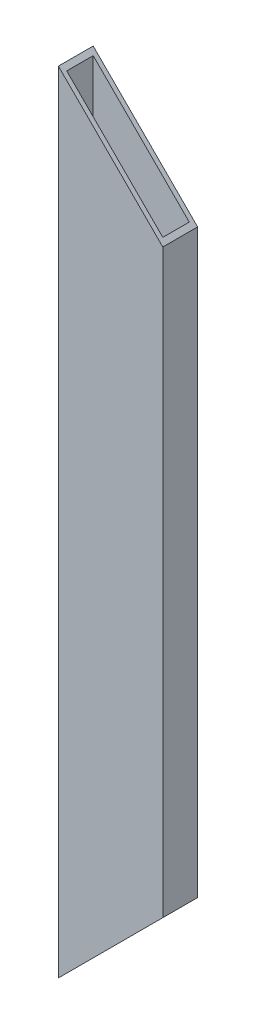
ISO-10303-21;
HEADER;
FILE_DESCRIPTION(('STEP AP214'),'2;1');
FILE_NAME('part.step','',(''),(''),'','','');
FILE_SCHEMA(('AUTOMOTIVE_DESIGN { 1 0 10303 214 1 1 1 1 }'));
ENDSEC;
DATA;
#1=APPLICATION_CONTEXT('core data for automotive mechanical design processes');
#2=APPLICATION_PROTOCOL_DEFINITION('international standard','automotive_design',2000,#1);
#3=PRODUCT_CONTEXT('',#1,'mechanical');
#4=PRODUCT('Part','Part','',(#3));
#5=PRODUCT_RELATED_PRODUCT_CATEGORY('part','',(#4));
#6=PRODUCT_DEFINITION_FORMATION('','',#4);
#7=PRODUCT_DEFINITION_CONTEXT('part definition',#1,'design');
#8=PRODUCT_DEFINITION('design','',#6,#7);
#9=PRODUCT_DEFINITION_SHAPE('','',#8);
#10=(LENGTH_UNIT() NAMED_UNIT(*) SI_UNIT(.MILLI.,.METRE.));
#11=(NAMED_UNIT(*) PLANE_ANGLE_UNIT() SI_UNIT($,.RADIAN.));
#12=(NAMED_UNIT(*) SI_UNIT($,.STERADIAN.) SOLID_ANGLE_UNIT());
#13=UNCERTAINTY_MEASURE_WITH_UNIT(LENGTH_MEASURE(1.E-05),#10,'distance_accuracy_value','');
#14=(GEOMETRIC_REPRESENTATION_CONTEXT(3) GLOBAL_UNCERTAINTY_ASSIGNED_CONTEXT((#13)) GLOBAL_UNIT_ASSIGNED_CONTEXT((#10,
#11,#12)) REPRESENTATION_CONTEXT('',''));
#15=CARTESIAN_POINT('',(0.,0.,0.));
#16=DIRECTION('',(0.,0.,1.));
#17=DIRECTION('',(1.,0.,0.));
#18=AXIS2_PLACEMENT_3D('',#15,#16,#17);
#19=CARTESIAN_POINT('',(-38.1,500.,-12.7));
#20=DIRECTION('',(1.,0.,0.));
#21=DIRECTION('',(0.,0.,-1.));
#22=AXIS2_PLACEMENT_3D('',#19,#20,#21);
#23=PLANE('',#22);
#24=DIRECTION('',(0.,-1.,0.));
#25=VECTOR('',#24,1.);
#26=CARTESIAN_POINT('',(-38.1,500.,-12.7));
#27=LINE('',#26,#25);
#28=CARTESIAN_POINT('',(-38.1,538.1,-12.7));
#29=VERTEX_POINT('',#28);
#30=CARTESIAN_POINT('',(-38.1,-38.1,-12.7));
#31=VERTEX_POINT('',#30);
#32=EDGE_CURVE('E124',#29,#31,#27,.T.);
#33=ORIENTED_EDGE('',*,*,#32,.T.);
#34=DIRECTION('',(0.,0.,-1.));
#35=VECTOR('',#34,1.);
#36=CARTESIAN_POINT('',(-38.1,-38.1,12.7));
#37=LINE('',#36,#35);
#38=CARTESIAN_POINT('',(-38.1,-38.1,12.7));
#39=VERTEX_POINT('',#38);
#40=EDGE_CURVE('E143',#39,#31,#37,.T.);
#41=ORIENTED_EDGE('',*,*,#40,.F.);
#42=DIRECTION('',(0.,-1.,0.));
#43=VECTOR('',#42,1.);
#44=CARTESIAN_POINT('',(-38.1,500.,12.7));
#45=LINE('',#44,#43);
#46=CARTESIAN_POINT('',(-38.1000000000001,538.1,12.7));
#47=VERTEX_POINT('',#46);
#48=EDGE_CURVE('E11',#47,#39,#45,.T.);
#49=ORIENTED_EDGE('',*,*,#48,.F.);
#50=DIRECTION('',(0.,0.,1.));
#51=VECTOR('',#50,1.);
#52=CARTESIAN_POINT('',(-38.1,538.1,-12.7));
#53=LINE('',#52,#51);
#54=EDGE_CURVE('E141',#29,#47,#53,.T.);
#55=ORIENTED_EDGE('',*,*,#54,.F.);
#56=EDGE_LOOP('',(#33,#41,#49,#55));
#57=FACE_BOUND('',#56,.T.);
#58=ADVANCED_FACE('F36',(#57),#23,.F.);
#59=CARTESIAN_POINT('',(-38.1,500.,-12.7));
#60=DIRECTION('',(0.,0.,1.));
#61=DIRECTION('',(1.,0.,0.));
#62=AXIS2_PLACEMENT_3D('',#59,#60,#61);
#63=PLANE('',#62);
#64=DIRECTION('',(0.,-1.,0.));
#65=VECTOR('',#64,1.);
#66=CARTESIAN_POINT('',(38.1,500.,-12.7));
#67=LINE('',#66,#65);
#68=CARTESIAN_POINT('',(38.1,461.9,-12.7));
#69=VERTEX_POINT('',#68);
#70=CARTESIAN_POINT('',(38.1,38.1,-12.7));
#71=VERTEX_POINT('',#70);
#72=EDGE_CURVE('E123',#69,#71,#67,.T.);
#73=ORIENTED_EDGE('',*,*,#72,.T.);
#74=DIRECTION('',(-0.707106781186548,-0.707106781186547,0.));
#75=VECTOR('',#74,1.);
#76=CARTESIAN_POINT('',(73.8061960740698,73.8061960740697,-12.7));
#77=LINE('',#76,#75);
#78=EDGE_CURVE('E104',#71,#31,#77,.T.);
#79=ORIENTED_EDGE('',*,*,#78,.T.);
#80=ORIENTED_EDGE('',*,*,#32,.F.);
#81=DIRECTION('',(0.707106781186548,-0.707106781186547,0.));
#82=VECTOR('',#81,1.);
#83=CARTESIAN_POINT('',(59.6358284291998,440.3641715708,-12.7));
#84=LINE('',#83,#82);
#85=EDGE_CURVE('E118',#29,#69,#84,.T.);
#86=ORIENTED_EDGE('',*,*,#85,.T.);
#87=EDGE_LOOP('',(#73,#79,#80,#86));
#88=FACE_BOUND('',#87,.T.);
#89=ADVANCED_FACE('F164',(#88),#63,.F.);
#90=CARTESIAN_POINT('',(38.1,500.,-12.7));
#91=DIRECTION('',(-1.,0.,0.));
#92=DIRECTION('',(0.,0.,1.));
#93=AXIS2_PLACEMENT_3D('',#90,#91,#92);
#94=PLANE('',#93);
#95=DIRECTION('',(0.,-1.,0.));
#96=VECTOR('',#95,1.);
#97=CARTESIAN_POINT('',(38.1,500.,12.7));
#98=LINE('',#97,#96);
#99=CARTESIAN_POINT('',(38.1,461.9,12.7));
#100=VERTEX_POINT('',#99);
#101=CARTESIAN_POINT('',(38.1,38.1,12.7));
#102=VERTEX_POINT('',#101);
#103=EDGE_CURVE('E43',#100,#102,#98,.T.);
#104=ORIENTED_EDGE('',*,*,#103,.T.);
#105=DIRECTION('',(0.,0.,-1.));
#106=VECTOR('',#105,1.);
#107=CARTESIAN_POINT('',(38.1,38.1,-12.7000000000001));
#108=LINE('',#107,#106);
#109=EDGE_CURVE('E99',#102,#71,#108,.T.);
#110=ORIENTED_EDGE('',*,*,#109,.T.);
#111=ORIENTED_EDGE('',*,*,#72,.F.);
#112=DIRECTION('',(0.,0.,1.));
#113=VECTOR('',#112,1.);
#114=CARTESIAN_POINT('',(38.1,461.9,-12.7));
#115=LINE('',#114,#113);
#116=EDGE_CURVE('E122',#69,#100,#115,.T.);
#117=ORIENTED_EDGE('',*,*,#116,.T.);
#118=EDGE_LOOP('',(#104,#110,#111,#117));
#119=FACE_BOUND('',#118,.T.);
#120=ADVANCED_FACE('F121',(#119),#94,.F.);
#121=CARTESIAN_POINT('',(-38.1,500.,12.7));
#122=DIRECTION('',(0.,0.,-1.));
#123=DIRECTION('',(-1.,0.,0.));
#124=AXIS2_PLACEMENT_3D('',#121,#122,#123);
#125=PLANE('',#124);
#126=ORIENTED_EDGE('',*,*,#48,.T.);
#127=DIRECTION('',(-0.707106781186548,-0.707106781186547,0.));
#128=VECTOR('',#127,1.);
#129=CARTESIAN_POINT('',(73.8061960740698,73.8061960740697,12.7));
#130=LINE('',#129,#128);
#131=EDGE_CURVE('E102',#102,#39,#130,.T.);
#132=ORIENTED_EDGE('',*,*,#131,.F.);
#133=ORIENTED_EDGE('',*,*,#103,.F.);
#134=DIRECTION('',(0.707106781186548,-0.707106781186547,0.));
#135=VECTOR('',#134,1.);
#136=CARTESIAN_POINT('',(59.6358284291998,440.3641715708,12.7));
#137=LINE('',#136,#135);
#138=EDGE_CURVE('E160',#47,#100,#137,.T.);
#139=ORIENTED_EDGE('',*,*,#138,.F.);
#140=EDGE_LOOP('',(#126,#132,#133,#139));
#141=FACE_BOUND('',#140,.T.);
#142=ADVANCED_FACE('F114',(#141),#125,.F.);
#143=CARTESIAN_POINT('',(73.8061960740698,73.8061960740697,-12.7));
#144=DIRECTION('',(-0.707106781186547,0.707106781186548,0.));
#145=DIRECTION('',(-0.707106781186548,-0.707106781186547,0.));
#146=AXIS2_PLACEMENT_3D('',#143,#144,#145);
#147=PLANE('',#146);
#148=DIRECTION('',(0.,0.,1.));
#149=VECTOR('',#148,1.);
#150=CARTESIAN_POINT('',(-35.052,-35.052,-9.65199999999999));
#151=LINE('',#150,#149);
#152=CARTESIAN_POINT('',(-35.0519999999999,-35.052,-9.65199999999999));
#153=VERTEX_POINT('',#152);
#154=CARTESIAN_POINT('',(-35.0519999999999,-35.052,9.652));
#155=VERTEX_POINT('',#154);
#156=EDGE_CURVE('E110',#153,#155,#151,.T.);
#157=ORIENTED_EDGE('',*,*,#156,.T.);
#158=DIRECTION('',(0.707106781186548,0.707106781186547,0.));
#159=VECTOR('',#158,1.);
#160=CARTESIAN_POINT('',(232.474,232.474,9.65199999999997));
#161=LINE('',#160,#159);
#162=CARTESIAN_POINT('',(35.052,35.052,9.65199999999999));
#163=VERTEX_POINT('',#162);
#164=EDGE_CURVE('E153',#155,#163,#161,.T.);
#165=ORIENTED_EDGE('',*,*,#164,.T.);
#166=DIRECTION('',(0.,0.,-1.));
#167=VECTOR('',#166,1.);
#168=CARTESIAN_POINT('',(35.052,35.052,-9.652));
#169=LINE('',#168,#167);
#170=CARTESIAN_POINT('',(35.052,35.052,-9.652));
#171=VERTEX_POINT('',#170);
#172=EDGE_CURVE('E50',#163,#171,#169,.T.);
#173=ORIENTED_EDGE('',*,*,#172,.T.);
#174=DIRECTION('',(-0.707106781186548,-0.707106781186547,0.));
#175=VECTOR('',#174,1.);
#176=CARTESIAN_POINT('',(232.474,232.474,-9.65200000000002));
#177=LINE('',#176,#175);
#178=EDGE_CURVE('E156',#171,#153,#177,.T.);
#179=ORIENTED_EDGE('',*,*,#178,.T.);
#180=EDGE_LOOP('',(#157,#165,#173,#179));
#181=FACE_BOUND('',#180,.T.);
#182=ORIENTED_EDGE('',*,*,#131,.T.);
#183=ORIENTED_EDGE('',*,*,#40,.T.);
#184=ORIENTED_EDGE('',*,*,#78,.F.);
#185=ORIENTED_EDGE('',*,*,#109,.F.);
#186=EDGE_LOOP('',(#182,#183,#184,#185));
#187=FACE_BOUND('',#186,.T.);
#188=ADVANCED_FACE('F101',(#181,#187),#147,.F.);
#189=CARTESIAN_POINT('',(59.6358284291998,440.3641715708,-12.7));
#190=DIRECTION('',(-0.707106781186547,-0.707106781186548,0.));
#191=DIRECTION('',(0.707106781186548,-0.707106781186547,0.));
#192=AXIS2_PLACEMENT_3D('',#189,#190,#191);
#193=PLANE('',#192);
#194=DIRECTION('',(0.,0.,-1.));
#195=VECTOR('',#194,1.);
#196=CARTESIAN_POINT('',(-35.052,535.052,-9.65199999999999));
#197=LINE('',#196,#195);
#198=CARTESIAN_POINT('',(-35.052,535.052,9.652));
#199=VERTEX_POINT('',#198);
#200=CARTESIAN_POINT('',(-35.052,535.052,-9.65199999999999));
#201=VERTEX_POINT('',#200);
#202=EDGE_CURVE('E58',#199,#201,#197,.T.);
#203=ORIENTED_EDGE('',*,*,#202,.T.);
#204=DIRECTION('',(0.707106781186548,-0.707106781186547,0.));
#205=VECTOR('',#204,1.);
#206=CARTESIAN_POINT('',(-17.526,517.526,-9.65199999999999));
#207=LINE('',#206,#205);
#208=CARTESIAN_POINT('',(35.052,464.948,-9.652));
#209=VERTEX_POINT('',#208);
#210=EDGE_CURVE('E109',#201,#209,#207,.T.);
#211=ORIENTED_EDGE('',*,*,#210,.T.);
#212=DIRECTION('',(0.,0.,1.));
#213=VECTOR('',#212,1.);
#214=CARTESIAN_POINT('',(35.052,464.948,-9.652));
#215=LINE('',#214,#213);
#216=CARTESIAN_POINT('',(35.052,464.948,9.65199999999999));
#217=VERTEX_POINT('',#216);
#218=EDGE_CURVE('E149',#209,#217,#215,.T.);
#219=ORIENTED_EDGE('',*,*,#218,.T.);
#220=DIRECTION('',(-0.707106781186548,0.707106781186547,0.));
#221=VECTOR('',#220,1.);
#222=CARTESIAN_POINT('',(-17.526,517.526,9.652));
#223=LINE('',#222,#221);
#224=EDGE_CURVE('E147',#217,#199,#223,.T.);
#225=ORIENTED_EDGE('',*,*,#224,.T.);
#226=EDGE_LOOP('',(#203,#211,#219,#225));
#227=FACE_BOUND('',#226,.T.);
#228=ORIENTED_EDGE('',*,*,#85,.F.);
#229=ORIENTED_EDGE('',*,*,#54,.T.);
#230=ORIENTED_EDGE('',*,*,#138,.T.);
#231=ORIENTED_EDGE('',*,*,#116,.F.);
#232=EDGE_LOOP('',(#228,#229,#230,#231));
#233=FACE_BOUND('',#232,.T.);
#234=ADVANCED_FACE('F168',(#227,#233),#193,.F.);
#235=CARTESIAN_POINT('',(-35.052,500.,-9.65199999999999));
#236=DIRECTION('',(1.,0.,0.));
#237=DIRECTION('',(0.,0.,-1.));
#238=AXIS2_PLACEMENT_3D('',#235,#236,#237);
#239=PLANE('',#238);
#240=ORIENTED_EDGE('',*,*,#156,.F.);
#241=DIRECTION('',(0.,-1.,0.));
#242=VECTOR('',#241,1.);
#243=CARTESIAN_POINT('',(-35.052,500.,-9.65199999999999));
#244=LINE('',#243,#242);
#245=EDGE_CURVE('E138',#201,#153,#244,.T.);
#246=ORIENTED_EDGE('',*,*,#245,.F.);
#247=ORIENTED_EDGE('',*,*,#202,.F.);
#248=DIRECTION('',(0.,-1.,0.));
#249=VECTOR('',#248,1.);
#250=CARTESIAN_POINT('',(-35.052,500.,9.652));
#251=LINE('',#250,#249);
#252=EDGE_CURVE('E129',#199,#155,#251,.T.);
#253=ORIENTED_EDGE('',*,*,#252,.T.);
#254=EDGE_LOOP('',(#240,#246,#247,#253));
#255=FACE_BOUND('',#254,.T.);
#256=ADVANCED_FACE('F170',(#255),#239,.T.);
#257=CARTESIAN_POINT('',(-35.052,500.,9.652));
#258=DIRECTION('',(0.,0.,-1.));
#259=DIRECTION('',(-1.,0.,0.));
#260=AXIS2_PLACEMENT_3D('',#257,#258,#259);
#261=PLANE('',#260);
#262=ORIENTED_EDGE('',*,*,#164,.F.);
#263=ORIENTED_EDGE('',*,*,#252,.F.);
#264=ORIENTED_EDGE('',*,*,#224,.F.);
#265=DIRECTION('',(0.,-1.,0.));
#266=VECTOR('',#265,1.);
#267=CARTESIAN_POINT('',(35.052,500.,9.65199999999999));
#268=LINE('',#267,#266);
#269=EDGE_CURVE('E132',#217,#163,#268,.T.);
#270=ORIENTED_EDGE('',*,*,#269,.T.);
#271=EDGE_LOOP('',(#262,#263,#264,#270));
#272=FACE_BOUND('',#271,.T.);
#273=ADVANCED_FACE('F176',(#272),#261,.T.);
#274=CARTESIAN_POINT('',(35.052,500.,-9.652));
#275=DIRECTION('',(-1.,0.,0.));
#276=DIRECTION('',(0.,0.,1.));
#277=AXIS2_PLACEMENT_3D('',#274,#275,#276);
#278=PLANE('',#277);
#279=ORIENTED_EDGE('',*,*,#172,.F.);
#280=ORIENTED_EDGE('',*,*,#269,.F.);
#281=ORIENTED_EDGE('',*,*,#218,.F.);
#282=DIRECTION('',(0.,-1.,0.));
#283=VECTOR('',#282,1.);
#284=CARTESIAN_POINT('',(35.052,500.,-9.652));
#285=LINE('',#284,#283);
#286=EDGE_CURVE('E135',#209,#171,#285,.T.);
#287=ORIENTED_EDGE('',*,*,#286,.T.);
#288=EDGE_LOOP('',(#279,#280,#281,#287));
#289=FACE_BOUND('',#288,.T.);
#290=ADVANCED_FACE('F222',(#289),#278,.T.);
#291=CARTESIAN_POINT('',(-35.052,500.,-9.65199999999999));
#292=DIRECTION('',(0.,0.,1.));
#293=DIRECTION('',(1.,0.,0.));
#294=AXIS2_PLACEMENT_3D('',#291,#292,#293);
#295=PLANE('',#294);
#296=ORIENTED_EDGE('',*,*,#178,.F.);
#297=ORIENTED_EDGE('',*,*,#286,.F.);
#298=ORIENTED_EDGE('',*,*,#210,.F.);
#299=ORIENTED_EDGE('',*,*,#245,.T.);
#300=EDGE_LOOP('',(#296,#297,#298,#299));
#301=FACE_BOUND('',#300,.T.);
#302=ADVANCED_FACE('F232',(#301),#295,.T.);
#303=CLOSED_SHELL('',(#58,#89,#120,#142,#188,#234,#256,#273,#290,#302));
#304=MANIFOLD_SOLID_BREP('B2',#303);
#305=ADVANCED_BREP_SHAPE_REPRESENTATION('',(#18,#304),#14);
#306=SHAPE_DEFINITION_REPRESENTATION(#9,#305);
ENDSEC;
END-ISO-10303-21;
